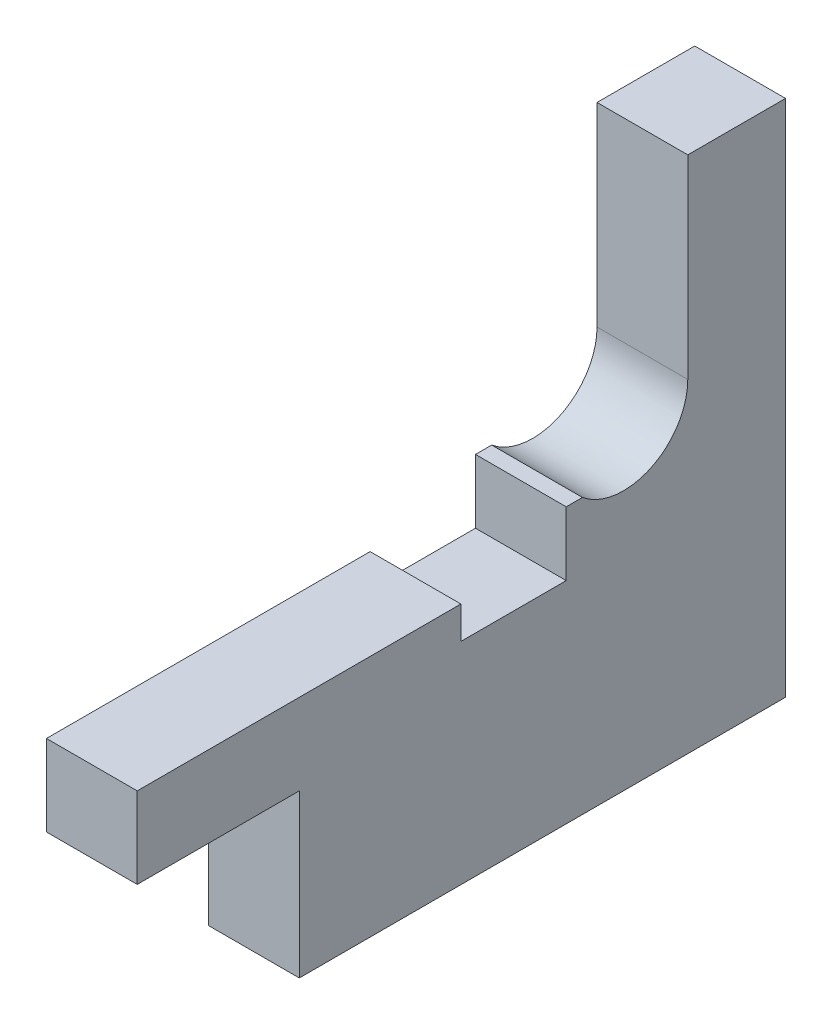
ISO-10303-21;
HEADER;
FILE_DESCRIPTION(('STEP AP214'),'2;1');
FILE_NAME('part.step','',(''),(''),'','','');
FILE_SCHEMA(('AUTOMOTIVE_DESIGN { 1 0 10303 214 1 1 1 1 }'));
ENDSEC;
DATA;
#1=APPLICATION_CONTEXT('core data for automotive mechanical design processes');
#2=APPLICATION_PROTOCOL_DEFINITION('international standard','automotive_design',2000,#1);
#3=PRODUCT_CONTEXT('',#1,'mechanical');
#4=PRODUCT('Part','Part','',(#3));
#5=PRODUCT_RELATED_PRODUCT_CATEGORY('part','',(#4));
#6=PRODUCT_DEFINITION_FORMATION('','',#4);
#7=PRODUCT_DEFINITION_CONTEXT('part definition',#1,'design');
#8=PRODUCT_DEFINITION('design','',#6,#7);
#9=PRODUCT_DEFINITION_SHAPE('','',#8);
#10=(LENGTH_UNIT() NAMED_UNIT(*) SI_UNIT(.MILLI.,.METRE.));
#11=(NAMED_UNIT(*) PLANE_ANGLE_UNIT() SI_UNIT($,.RADIAN.));
#12=(NAMED_UNIT(*) SI_UNIT($,.STERADIAN.) SOLID_ANGLE_UNIT());
#13=UNCERTAINTY_MEASURE_WITH_UNIT(LENGTH_MEASURE(1.E-05),#10,'distance_accuracy_value','');
#14=(GEOMETRIC_REPRESENTATION_CONTEXT(3) GLOBAL_UNCERTAINTY_ASSIGNED_CONTEXT((#13)) GLOBAL_UNIT_ASSIGNED_CONTEXT((#10,
#11,#12)) REPRESENTATION_CONTEXT('',''));
#15=CARTESIAN_POINT('',(0.,0.,0.));
#16=DIRECTION('',(0.,0.,1.));
#17=DIRECTION('',(1.,0.,0.));
#18=AXIS2_PLACEMENT_3D('',#15,#16,#17);
#19=CARTESIAN_POINT('',(5.6,-3.05675481515937,3.53125));
#20=DIRECTION('',(0.,1.,0.));
#21=DIRECTION('',(0.,0.,1.));
#22=AXIS2_PLACEMENT_3D('',#19,#20,#21);
#23=PLANE('',#22);
#24=DIRECTION('',(0.,0.,-1.));
#25=VECTOR('',#24,1.);
#26=CARTESIAN_POINT('',(0.,-3.05675481515937,3.53125));
#27=LINE('',#26,#25);
#28=CARTESIAN_POINT('',(0.,-3.05675481515937,3.53125));
#29=VERTEX_POINT('',#28);
#30=CARTESIAN_POINT('',(0.,-3.05675481515937,2.53125));
#31=VERTEX_POINT('',#30);
#32=EDGE_CURVE('E178',#29,#31,#27,.T.);
#33=ORIENTED_EDGE('',*,*,#32,.F.);
#34=DIRECTION('',(-1.,0.,0.));
#35=VECTOR('',#34,1.);
#36=CARTESIAN_POINT('',(5.6,-3.05675481515937,3.53125));
#37=LINE('',#36,#35);
#38=CARTESIAN_POINT('',(5.6,-3.05675481515937,3.53125));
#39=VERTEX_POINT('',#38);
#40=EDGE_CURVE('E11',#39,#29,#37,.T.);
#41=ORIENTED_EDGE('',*,*,#40,.F.);
#42=DIRECTION('',(0.,0.,-1.));
#43=VECTOR('',#42,1.);
#44=CARTESIAN_POINT('',(5.6,-3.05675481515937,3.53125));
#45=LINE('',#44,#43);
#46=CARTESIAN_POINT('',(5.6,-3.05675481515937,2.53125));
#47=VERTEX_POINT('',#46);
#48=EDGE_CURVE('E226',#39,#47,#45,.T.);
#49=ORIENTED_EDGE('',*,*,#48,.T.);
#50=DIRECTION('',(-1.,0.,0.));
#51=VECTOR('',#50,1.);
#52=CARTESIAN_POINT('',(5.6,-3.05675481515937,2.53125));
#53=LINE('',#52,#51);
#54=EDGE_CURVE('E48',#47,#31,#53,.T.);
#55=ORIENTED_EDGE('',*,*,#54,.T.);
#56=EDGE_LOOP('',(#33,#41,#49,#55));
#57=FACE_BOUND('',#56,.T.);
#58=ADVANCED_FACE('F45',(#57),#23,.T.);
#59=CARTESIAN_POINT('',(5.6,-7.00000000000001,3.53125));
#60=DIRECTION('',(0.,0.,1.));
#61=DIRECTION('',(0.,-1.,0.));
#62=AXIS2_PLACEMENT_3D('',#59,#60,#61);
#63=PLANE('',#62);
#64=DIRECTION('',(0.,1.,0.));
#65=VECTOR('',#64,1.);
#66=CARTESIAN_POINT('',(0.,-7.00000000000001,3.53125));
#67=LINE('',#66,#65);
#68=CARTESIAN_POINT('',(0.,-7.00000000000001,3.53125));
#69=VERTEX_POINT('',#68);
#70=EDGE_CURVE('E223',#69,#29,#67,.T.);
#71=ORIENTED_EDGE('',*,*,#70,.F.);
#72=DIRECTION('',(-1.,0.,0.));
#73=VECTOR('',#72,1.);
#74=CARTESIAN_POINT('',(5.6,-7.00000000000001,3.53125));
#75=LINE('',#74,#73);
#76=CARTESIAN_POINT('',(5.6,-7.00000000000001,3.53125));
#77=VERTEX_POINT('',#76);
#78=EDGE_CURVE('E55',#77,#69,#75,.T.);
#79=ORIENTED_EDGE('',*,*,#78,.F.);
#80=DIRECTION('',(0.,1.,0.));
#81=VECTOR('',#80,1.);
#82=CARTESIAN_POINT('',(5.6,-7.00000000000001,3.53125));
#83=LINE('',#82,#81);
#84=EDGE_CURVE('E164',#77,#39,#83,.T.);
#85=ORIENTED_EDGE('',*,*,#84,.T.);
#86=ORIENTED_EDGE('',*,*,#40,.T.);
#87=EDGE_LOOP('',(#71,#79,#85,#86));
#88=FACE_BOUND('',#87,.T.);
#89=ADVANCED_FACE('F259',(#88),#63,.T.);
#90=CARTESIAN_POINT('',(5.6,-7.00000000000001,10.03125));
#91=DIRECTION('',(0.,1.,0.));
#92=DIRECTION('',(0.,0.,1.));
#93=AXIS2_PLACEMENT_3D('',#90,#91,#92);
#94=PLANE('',#93);
#95=DIRECTION('',(0.,0.,-1.));
#96=VECTOR('',#95,1.);
#97=CARTESIAN_POINT('',(0.,-7.00000000000001,10.03125));
#98=LINE('',#97,#96);
#99=CARTESIAN_POINT('',(0.,-7.00000000000001,10.03125));
#100=VERTEX_POINT('',#99);
#101=EDGE_CURVE('E150',#100,#69,#98,.T.);
#102=ORIENTED_EDGE('',*,*,#101,.F.);
#103=DIRECTION('',(-1.,0.,0.));
#104=VECTOR('',#103,1.);
#105=CARTESIAN_POINT('',(5.6,-7.00000000000001,10.03125));
#106=LINE('',#105,#104);
#107=CARTESIAN_POINT('',(5.6,-7.00000000000001,10.03125));
#108=VERTEX_POINT('',#107);
#109=EDGE_CURVE('E145',#108,#100,#106,.T.);
#110=ORIENTED_EDGE('',*,*,#109,.F.);
#111=DIRECTION('',(0.,0.,-1.));
#112=VECTOR('',#111,1.);
#113=CARTESIAN_POINT('',(5.6,-7.00000000000001,10.03125));
#114=LINE('',#113,#112);
#115=EDGE_CURVE('E148',#108,#77,#114,.T.);
#116=ORIENTED_EDGE('',*,*,#115,.T.);
#117=ORIENTED_EDGE('',*,*,#78,.T.);
#118=EDGE_LOOP('',(#102,#110,#116,#117));
#119=FACE_BOUND('',#118,.T.);
#120=ADVANCED_FACE('F147',(#119),#94,.T.);
#121=CARTESIAN_POINT('',(5.6,-5.00000000000001,10.03125));
#122=DIRECTION('',(0.,0.,-1.));
#123=DIRECTION('',(-1.,0.,0.));
#124=AXIS2_PLACEMENT_3D('',#121,#122,#123);
#125=PLANE('',#124);
#126=DIRECTION('',(0.,-1.,0.));
#127=VECTOR('',#126,1.);
#128=CARTESIAN_POINT('',(0.,-5.00000000000001,10.03125));
#129=LINE('',#128,#127);
#130=CARTESIAN_POINT('',(0.,-5.00000000000001,10.03125));
#131=VERTEX_POINT('',#130);
#132=EDGE_CURVE('E218',#131,#100,#129,.T.);
#133=ORIENTED_EDGE('',*,*,#132,.F.);
#134=DIRECTION('',(-1.,0.,0.));
#135=VECTOR('',#134,1.);
#136=CARTESIAN_POINT('',(5.6,-5.00000000000001,10.03125));
#137=LINE('',#136,#135);
#138=CARTESIAN_POINT('',(5.6,-5.00000000000001,10.03125));
#139=VERTEX_POINT('',#138);
#140=EDGE_CURVE('E156',#139,#131,#137,.T.);
#141=ORIENTED_EDGE('',*,*,#140,.F.);
#142=DIRECTION('',(0.,-1.,0.));
#143=VECTOR('',#142,1.);
#144=CARTESIAN_POINT('',(5.6,-5.00000000000001,10.03125));
#145=LINE('',#144,#143);
#146=EDGE_CURVE('E162',#139,#108,#145,.T.);
#147=ORIENTED_EDGE('',*,*,#146,.T.);
#148=ORIENTED_EDGE('',*,*,#109,.T.);
#149=EDGE_LOOP('',(#133,#141,#147,#148));
#150=FACE_BOUND('',#149,.T.);
#151=ADVANCED_FACE('F167',(#150),#125,.T.);
#152=CARTESIAN_POINT('',(5.6,-5.,30.));
#153=DIRECTION('',(0.,1.,0.));
#154=DIRECTION('',(0.,0.,1.));
#155=AXIS2_PLACEMENT_3D('',#152,#153,#154);
#156=PLANE('',#155);
#157=DIRECTION('',(0.,0.,-1.));
#158=VECTOR('',#157,1.);
#159=CARTESIAN_POINT('',(0.,-5.,30.));
#160=LINE('',#159,#158);
#161=CARTESIAN_POINT('',(0.,-5.,30.));
#162=VERTEX_POINT('',#161);
#163=EDGE_CURVE('E214',#162,#131,#160,.T.);
#164=ORIENTED_EDGE('',*,*,#163,.F.);
#165=DIRECTION('',(-1.,0.,0.));
#166=VECTOR('',#165,1.);
#167=CARTESIAN_POINT('',(5.6,-5.,30.));
#168=LINE('',#167,#166);
#169=CARTESIAN_POINT('',(5.6,-5.,30.));
#170=VERTEX_POINT('',#169);
#171=EDGE_CURVE('E232',#170,#162,#168,.T.);
#172=ORIENTED_EDGE('',*,*,#171,.F.);
#173=DIRECTION('',(0.,0.,-1.));
#174=VECTOR('',#173,1.);
#175=CARTESIAN_POINT('',(5.6,-5.,30.));
#176=LINE('',#175,#174);
#177=EDGE_CURVE('E169',#170,#139,#176,.T.);
#178=ORIENTED_EDGE('',*,*,#177,.T.);
#179=ORIENTED_EDGE('',*,*,#140,.T.);
#180=EDGE_LOOP('',(#164,#172,#178,#179));
#181=FACE_BOUND('',#180,.T.);
#182=ADVANCED_FACE('F272',(#181),#156,.T.);
#183=CARTESIAN_POINT('',(5.6,-10.,30.));
#184=DIRECTION('',(0.,0.,1.));
#185=DIRECTION('',(1.,0.,0.));
#186=AXIS2_PLACEMENT_3D('',#183,#184,#185);
#187=PLANE('',#186);
#188=DIRECTION('',(0.,1.,0.));
#189=VECTOR('',#188,1.);
#190=CARTESIAN_POINT('',(0.,-10.,30.));
#191=LINE('',#190,#189);
#192=CARTESIAN_POINT('',(0.,-10.,30.));
#193=VERTEX_POINT('',#192);
#194=EDGE_CURVE('E210',#193,#162,#191,.T.);
#195=ORIENTED_EDGE('',*,*,#194,.F.);
#196=DIRECTION('',(-1.,0.,0.));
#197=VECTOR('',#196,1.);
#198=CARTESIAN_POINT('',(5.6,-10.,30.));
#199=LINE('',#198,#197);
#200=CARTESIAN_POINT('',(5.6,-10.,30.));
#201=VERTEX_POINT('',#200);
#202=EDGE_CURVE('E235',#201,#193,#199,.T.);
#203=ORIENTED_EDGE('',*,*,#202,.F.);
#204=DIRECTION('',(0.,1.,0.));
#205=VECTOR('',#204,1.);
#206=CARTESIAN_POINT('',(5.6,-10.,30.));
#207=LINE('',#206,#205);
#208=EDGE_CURVE('E172',#201,#170,#207,.T.);
#209=ORIENTED_EDGE('',*,*,#208,.T.);
#210=ORIENTED_EDGE('',*,*,#171,.T.);
#211=EDGE_LOOP('',(#195,#203,#209,#210));
#212=FACE_BOUND('',#211,.T.);
#213=ADVANCED_FACE('F275',(#212),#187,.T.);
#214=CARTESIAN_POINT('',(5.6,-10.,20.));
#215=DIRECTION('',(0.,-1.,0.));
#216=DIRECTION('',(0.,0.,-1.));
#217=AXIS2_PLACEMENT_3D('',#214,#215,#216);
#218=PLANE('',#217);
#219=DIRECTION('',(0.,0.,1.));
#220=VECTOR('',#219,1.);
#221=CARTESIAN_POINT('',(0.,-10.,20.));
#222=LINE('',#221,#220);
#223=CARTESIAN_POINT('',(0.,-10.,20.));
#224=VERTEX_POINT('',#223);
#225=EDGE_CURVE('E206',#224,#193,#222,.T.);
#226=ORIENTED_EDGE('',*,*,#225,.F.);
#227=DIRECTION('',(-1.,0.,0.));
#228=VECTOR('',#227,1.);
#229=CARTESIAN_POINT('',(5.6,-10.,20.));
#230=LINE('',#229,#228);
#231=CARTESIAN_POINT('',(5.6,-10.,20.));
#232=VERTEX_POINT('',#231);
#233=EDGE_CURVE('E238',#232,#224,#230,.T.);
#234=ORIENTED_EDGE('',*,*,#233,.F.);
#235=DIRECTION('',(0.,0.,1.));
#236=VECTOR('',#235,1.);
#237=CARTESIAN_POINT('',(5.6,-10.,20.));
#238=LINE('',#237,#236);
#239=EDGE_CURVE('E415',#232,#201,#238,.T.);
#240=ORIENTED_EDGE('',*,*,#239,.T.);
#241=ORIENTED_EDGE('',*,*,#202,.T.);
#242=EDGE_LOOP('',(#226,#234,#240,#241));
#243=FACE_BOUND('',#242,.T.);
#244=ADVANCED_FACE('F279',(#243),#218,.T.);
#245=CARTESIAN_POINT('',(5.6,-20.,20.));
#246=DIRECTION('',(0.,0.,1.));
#247=DIRECTION('',(0.,-1.,0.));
#248=AXIS2_PLACEMENT_3D('',#245,#246,#247);
#249=PLANE('',#248);
#250=DIRECTION('',(0.,1.,0.));
#251=VECTOR('',#250,1.);
#252=CARTESIAN_POINT('',(0.,-20.,20.));
#253=LINE('',#252,#251);
#254=CARTESIAN_POINT('',(0.,-20.,20.));
#255=VERTEX_POINT('',#254);
#256=EDGE_CURVE('E202',#255,#224,#253,.T.);
#257=ORIENTED_EDGE('',*,*,#256,.F.);
#258=DIRECTION('',(-1.,0.,0.));
#259=VECTOR('',#258,1.);
#260=CARTESIAN_POINT('',(5.6,-20.,20.));
#261=LINE('',#260,#259);
#262=CARTESIAN_POINT('',(5.6,-20.,20.));
#263=VERTEX_POINT('',#262);
#264=EDGE_CURVE('E241',#263,#255,#261,.T.);
#265=ORIENTED_EDGE('',*,*,#264,.F.);
#266=DIRECTION('',(0.,1.,0.));
#267=VECTOR('',#266,1.);
#268=CARTESIAN_POINT('',(5.6,-20.,20.));
#269=LINE('',#268,#267);
#270=EDGE_CURVE('E411',#263,#232,#269,.T.);
#271=ORIENTED_EDGE('',*,*,#270,.T.);
#272=ORIENTED_EDGE('',*,*,#233,.T.);
#273=EDGE_LOOP('',(#257,#265,#271,#272));
#274=FACE_BOUND('',#273,.T.);
#275=ADVANCED_FACE('F283',(#274),#249,.T.);
#276=CARTESIAN_POINT('',(5.6,-20.,-10.));
#277=DIRECTION('',(0.,-1.,0.));
#278=DIRECTION('',(0.,0.,-1.));
#279=AXIS2_PLACEMENT_3D('',#276,#277,#278);
#280=PLANE('',#279);
#281=DIRECTION('',(0.,0.,1.));
#282=VECTOR('',#281,1.);
#283=CARTESIAN_POINT('',(0.,-20.,-10.));
#284=LINE('',#283,#282);
#285=CARTESIAN_POINT('',(0.,-20.,-10.));
#286=VERTEX_POINT('',#285);
#287=EDGE_CURVE('E198',#286,#255,#284,.T.);
#288=ORIENTED_EDGE('',*,*,#287,.F.);
#289=DIRECTION('',(-1.,0.,0.));
#290=VECTOR('',#289,1.);
#291=CARTESIAN_POINT('',(5.6,-20.,-10.));
#292=LINE('',#291,#290);
#293=CARTESIAN_POINT('',(5.6,-20.,-10.));
#294=VERTEX_POINT('',#293);
#295=EDGE_CURVE('E244',#294,#286,#292,.T.);
#296=ORIENTED_EDGE('',*,*,#295,.F.);
#297=DIRECTION('',(0.,0.,1.));
#298=VECTOR('',#297,1.);
#299=CARTESIAN_POINT('',(5.6,-20.,-10.));
#300=LINE('',#299,#298);
#301=EDGE_CURVE('E425',#294,#263,#300,.T.);
#302=ORIENTED_EDGE('',*,*,#301,.T.);
#303=ORIENTED_EDGE('',*,*,#264,.T.);
#304=EDGE_LOOP('',(#288,#296,#302,#303));
#305=FACE_BOUND('',#304,.T.);
#306=ADVANCED_FACE('F287',(#305),#280,.T.);
#307=CARTESIAN_POINT('',(5.6,12.,-10.));
#308=DIRECTION('',(0.,0.,-1.));
#309=DIRECTION('',(0.,1.,0.));
#310=AXIS2_PLACEMENT_3D('',#307,#308,#309);
#311=PLANE('',#310);
#312=DIRECTION('',(0.,-1.,0.));
#313=VECTOR('',#312,1.);
#314=CARTESIAN_POINT('',(0.,12.,-10.));
#315=LINE('',#314,#313);
#316=CARTESIAN_POINT('',(0.,12.,-10.));
#317=VERTEX_POINT('',#316);
#318=EDGE_CURVE('E194',#317,#286,#315,.T.);
#319=ORIENTED_EDGE('',*,*,#318,.F.);
#320=DIRECTION('',(-1.,0.,0.));
#321=VECTOR('',#320,1.);
#322=CARTESIAN_POINT('',(5.6,12.,-10.));
#323=LINE('',#322,#321);
#324=CARTESIAN_POINT('',(5.6,12.,-10.));
#325=VERTEX_POINT('',#324);
#326=EDGE_CURVE('E247',#325,#317,#323,.T.);
#327=ORIENTED_EDGE('',*,*,#326,.F.);
#328=DIRECTION('',(0.,-1.,0.));
#329=VECTOR('',#328,1.);
#330=CARTESIAN_POINT('',(5.6,12.,-10.));
#331=LINE('',#330,#329);
#332=EDGE_CURVE('E404',#325,#294,#331,.T.);
#333=ORIENTED_EDGE('',*,*,#332,.T.);
#334=ORIENTED_EDGE('',*,*,#295,.T.);
#335=EDGE_LOOP('',(#319,#327,#333,#334));
#336=FACE_BOUND('',#335,.T.);
#337=ADVANCED_FACE('F291',(#336),#311,.T.);
#338=CARTESIAN_POINT('',(5.6,12.,-3.96875));
#339=DIRECTION('',(0.,1.,0.));
#340=DIRECTION('',(0.,0.,1.));
#341=AXIS2_PLACEMENT_3D('',#338,#339,#340);
#342=PLANE('',#341);
#343=DIRECTION('',(0.,0.,-1.));
#344=VECTOR('',#343,1.);
#345=CARTESIAN_POINT('',(0.,12.,-3.96875));
#346=LINE('',#345,#344);
#347=CARTESIAN_POINT('',(0.,12.,-3.96875));
#348=VERTEX_POINT('',#347);
#349=EDGE_CURVE('E190',#348,#317,#346,.T.);
#350=ORIENTED_EDGE('',*,*,#349,.F.);
#351=DIRECTION('',(-1.,0.,0.));
#352=VECTOR('',#351,1.);
#353=CARTESIAN_POINT('',(5.6,12.,-3.96875));
#354=LINE('',#353,#352);
#355=CARTESIAN_POINT('',(5.6,12.,-3.96875));
#356=VERTEX_POINT('',#355);
#357=EDGE_CURVE('E250',#356,#348,#354,.T.);
#358=ORIENTED_EDGE('',*,*,#357,.F.);
#359=DIRECTION('',(0.,0.,-1.));
#360=VECTOR('',#359,1.);
#361=CARTESIAN_POINT('',(5.6,12.,-3.96875));
#362=LINE('',#361,#360);
#363=EDGE_CURVE('E400',#356,#325,#362,.T.);
#364=ORIENTED_EDGE('',*,*,#363,.T.);
#365=ORIENTED_EDGE('',*,*,#326,.T.);
#366=EDGE_LOOP('',(#350,#358,#364,#365));
#367=FACE_BOUND('',#366,.T.);
#368=ADVANCED_FACE('F295',(#367),#342,.T.);
#369=CARTESIAN_POINT('',(5.6,0.,-3.96875));
#370=DIRECTION('',(0.,0.,1.));
#371=DIRECTION('',(1.,0.,0.));
#372=AXIS2_PLACEMENT_3D('',#369,#370,#371);
#373=PLANE('',#372);
#374=DIRECTION('',(0.,1.,0.));
#375=VECTOR('',#374,1.);
#376=CARTESIAN_POINT('',(0.,0.,-3.96875));
#377=LINE('',#376,#375);
#378=CARTESIAN_POINT('',(0.,0.,-3.96875));
#379=VERTEX_POINT('',#378);
#380=EDGE_CURVE('E186',#379,#348,#377,.T.);
#381=ORIENTED_EDGE('',*,*,#380,.F.);
#382=DIRECTION('',(-1.,0.,0.));
#383=VECTOR('',#382,1.);
#384=CARTESIAN_POINT('',(5.6,0.,-3.96875));
#385=LINE('',#384,#383);
#386=CARTESIAN_POINT('',(5.6,0.,-3.96875));
#387=VERTEX_POINT('',#386);
#388=EDGE_CURVE('E252',#387,#379,#385,.T.);
#389=ORIENTED_EDGE('',*,*,#388,.F.);
#390=DIRECTION('',(0.,1.,0.));
#391=VECTOR('',#390,1.);
#392=CARTESIAN_POINT('',(5.6,0.,-3.96875));
#393=LINE('',#392,#391);
#394=EDGE_CURVE('E432',#387,#356,#393,.T.);
#395=ORIENTED_EDGE('',*,*,#394,.T.);
#396=ORIENTED_EDGE('',*,*,#357,.T.);
#397=EDGE_LOOP('',(#381,#389,#395,#396));
#398=FACE_BOUND('',#397,.T.);
#399=ADVANCED_FACE('F299',(#398),#373,.T.);
#400=CARTESIAN_POINT('',(5.6,0.,0.));
#401=DIRECTION('',(-1.,0.,0.));
#402=DIRECTION('',(0.,0.,1.));
#403=AXIS2_PLACEMENT_3D('',#400,#401,#402);
#404=CYLINDRICAL_SURFACE('',#403,3.96875);
#405=CARTESIAN_POINT('',(0.,0.,0.));
#406=DIRECTION('',(1.,0.,0.));
#407=DIRECTION('',(0.,0.,-1.));
#408=AXIS2_PLACEMENT_3D('',#405,#406,#407);
#409=CIRCLE('',#408,3.96875);
#410=EDGE_CURVE('E182',#31,#379,#409,.T.);
#411=ORIENTED_EDGE('',*,*,#410,.F.);
#412=ORIENTED_EDGE('',*,*,#54,.F.);
#413=CARTESIAN_POINT('',(5.6,0.,0.));
#414=DIRECTION('',(1.,0.,0.));
#415=DIRECTION('',(0.,0.,-1.));
#416=AXIS2_PLACEMENT_3D('',#413,#414,#415);
#417=CIRCLE('',#416,3.96875);
#418=EDGE_CURVE('E435',#47,#387,#417,.T.);
#419=ORIENTED_EDGE('',*,*,#418,.T.);
#420=ORIENTED_EDGE('',*,*,#388,.T.);
#421=EDGE_LOOP('',(#411,#412,#419,#420));
#422=FACE_BOUND('',#421,.T.);
#423=ADVANCED_FACE('F256',(#422),#404,.F.);
#424=CARTESIAN_POINT('',(5.6,0.,0.));
#425=DIRECTION('',(1.,0.,0.));
#426=DIRECTION('',(0.,0.,-1.));
#427=AXIS2_PLACEMENT_3D('',#424,#425,#426);
#428=PLANE('',#427);
#429=ORIENTED_EDGE('',*,*,#48,.F.);
#430=ORIENTED_EDGE('',*,*,#84,.F.);
#431=ORIENTED_EDGE('',*,*,#115,.F.);
#432=ORIENTED_EDGE('',*,*,#146,.F.);
#433=ORIENTED_EDGE('',*,*,#177,.F.);
#434=ORIENTED_EDGE('',*,*,#208,.F.);
#435=ORIENTED_EDGE('',*,*,#239,.F.);
#436=ORIENTED_EDGE('',*,*,#270,.F.);
#437=ORIENTED_EDGE('',*,*,#301,.F.);
#438=ORIENTED_EDGE('',*,*,#332,.F.);
#439=ORIENTED_EDGE('',*,*,#363,.F.);
#440=ORIENTED_EDGE('',*,*,#394,.F.);
#441=ORIENTED_EDGE('',*,*,#418,.F.);
#442=EDGE_LOOP('',(#429,#430,#431,#432,#433,#434,#435,#436,#437,#438,#439,#440,#441));
#443=FACE_BOUND('',#442,.T.);
#444=ADVANCED_FACE('F160',(#443),#428,.T.);
#445=CARTESIAN_POINT('',(0.,0.,0.));
#446=DIRECTION('',(1.,0.,0.));
#447=DIRECTION('',(0.,0.,-1.));
#448=AXIS2_PLACEMENT_3D('',#445,#446,#447);
#449=PLANE('',#448);
#450=ORIENTED_EDGE('',*,*,#32,.T.);
#451=ORIENTED_EDGE('',*,*,#410,.T.);
#452=ORIENTED_EDGE('',*,*,#380,.T.);
#453=ORIENTED_EDGE('',*,*,#349,.T.);
#454=ORIENTED_EDGE('',*,*,#318,.T.);
#455=ORIENTED_EDGE('',*,*,#287,.T.);
#456=ORIENTED_EDGE('',*,*,#256,.T.);
#457=ORIENTED_EDGE('',*,*,#225,.T.);
#458=ORIENTED_EDGE('',*,*,#194,.T.);
#459=ORIENTED_EDGE('',*,*,#163,.T.);
#460=ORIENTED_EDGE('',*,*,#132,.T.);
#461=ORIENTED_EDGE('',*,*,#101,.T.);
#462=ORIENTED_EDGE('',*,*,#70,.T.);
#463=EDGE_LOOP('',(#450,#451,#452,#453,#454,#455,#456,#457,#458,#459,#460,#461,#462));
#464=FACE_BOUND('',#463,.T.);
#465=ADVANCED_FACE('F258',(#464),#449,.F.);
#466=CLOSED_SHELL('',(#58,#89,#120,#151,#182,#213,#244,#275,#306,#337,#368,#399,#423,#444,#465));
#467=MANIFOLD_SOLID_BREP('B2',#466);
#468=ADVANCED_BREP_SHAPE_REPRESENTATION('',(#18,#467),#14);
#469=SHAPE_DEFINITION_REPRESENTATION(#9,#468);
ENDSEC;
END-ISO-10303-21;
